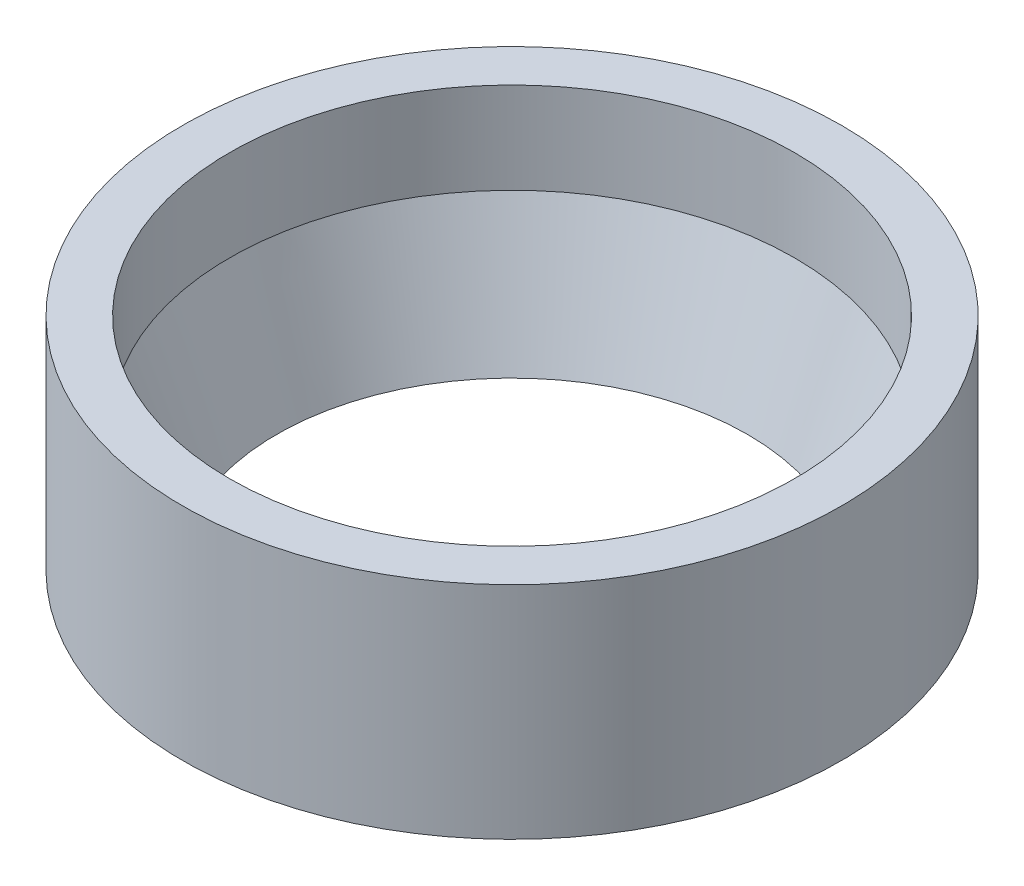
ISO-10303-21;
HEADER;
FILE_DESCRIPTION(('STEP AP214'),'2;1');
FILE_NAME('part.step','',(''),(''),'','','');
FILE_SCHEMA(('AUTOMOTIVE_DESIGN { 1 0 10303 214 1 1 1 1 }'));
ENDSEC;
DATA;
#1=APPLICATION_CONTEXT('core data for automotive mechanical design processes');
#2=APPLICATION_PROTOCOL_DEFINITION('international standard','automotive_design',2000,#1);
#3=PRODUCT_CONTEXT('',#1,'mechanical');
#4=PRODUCT('Part','Part','',(#3));
#5=PRODUCT_RELATED_PRODUCT_CATEGORY('part','',(#4));
#6=PRODUCT_DEFINITION_FORMATION('','',#4);
#7=PRODUCT_DEFINITION_CONTEXT('part definition',#1,'design');
#8=PRODUCT_DEFINITION('design','',#6,#7);
#9=PRODUCT_DEFINITION_SHAPE('','',#8);
#10=(LENGTH_UNIT() NAMED_UNIT(*) SI_UNIT(.MILLI.,.METRE.));
#11=(NAMED_UNIT(*) PLANE_ANGLE_UNIT() SI_UNIT($,.RADIAN.));
#12=(NAMED_UNIT(*) SI_UNIT($,.STERADIAN.) SOLID_ANGLE_UNIT());
#13=UNCERTAINTY_MEASURE_WITH_UNIT(LENGTH_MEASURE(1.E-05),#10,'distance_accuracy_value','');
#14=(GEOMETRIC_REPRESENTATION_CONTEXT(3) GLOBAL_UNCERTAINTY_ASSIGNED_CONTEXT((#13)) GLOBAL_UNIT_ASSIGNED_CONTEXT((#10,
#11,#12)) REPRESENTATION_CONTEXT('',''));
#15=CARTESIAN_POINT('',(0.,0.,0.));
#16=DIRECTION('',(0.,0.,1.));
#17=DIRECTION('',(1.,0.,0.));
#18=AXIS2_PLACEMENT_3D('',#15,#16,#17);
#19=CARTESIAN_POINT('',(0.,0.,0.));
#20=DIRECTION('',(0.,-1.,0.));
#21=DIRECTION('',(0.,0.,-1.));
#22=AXIS2_PLACEMENT_3D('',#19,#20,#21);
#23=PLANE('',#22);
#24=CARTESIAN_POINT('',(0.,0.,0.));
#25=DIRECTION('',(0.,-1.,0.));
#26=DIRECTION('',(0.,0.,-1.));
#27=AXIS2_PLACEMENT_3D('',#24,#25,#26);
#28=CIRCLE('',#27,44.45);
#29=CARTESIAN_POINT('',(0.,0.,-44.45));
#30=VERTEX_POINT('',#29);
#31=EDGE_CURVE('E10',#30,#30,#28,.T.);
#32=ORIENTED_EDGE('',*,*,#31,.F.);
#33=EDGE_LOOP('',(#32));
#34=FACE_BOUND('',#33,.T.);
#35=CARTESIAN_POINT('',(0.,0.,0.));
#36=DIRECTION('',(0.,-1.,0.));
#37=DIRECTION('',(0.,0.,-1.));
#38=AXIS2_PLACEMENT_3D('',#35,#36,#37);
#39=CIRCLE('',#38,38.1);
#40=CARTESIAN_POINT('',(0.,0.,-38.1));
#41=VERTEX_POINT('',#40);
#42=EDGE_CURVE('E53',#41,#41,#39,.T.);
#43=ORIENTED_EDGE('',*,*,#42,.T.);
#44=EDGE_LOOP('',(#43));
#45=FACE_BOUND('',#44,.T.);
#46=ADVANCED_FACE('F34',(#34,#45),#23,.F.);
#47=CARTESIAN_POINT('',(0.,0.,0.));
#48=DIRECTION('',(0.,-1.,0.));
#49=DIRECTION('',(0.,0.,-1.));
#50=AXIS2_PLACEMENT_3D('',#47,#48,#49);
#51=CYLINDRICAL_SURFACE('',#50,44.45);
#52=CARTESIAN_POINT('',(0.,-29.7434,0.));
#53=DIRECTION('',(0.,-1.,0.));
#54=DIRECTION('',(0.,0.,-1.));
#55=AXIS2_PLACEMENT_3D('',#52,#53,#54);
#56=CIRCLE('',#55,44.45);
#57=CARTESIAN_POINT('',(0.,-29.7434,-44.45));
#58=VERTEX_POINT('',#57);
#59=EDGE_CURVE('E40',#58,#58,#56,.T.);
#60=ORIENTED_EDGE('',*,*,#59,.F.);
#61=EDGE_LOOP('',(#60));
#62=FACE_BOUND('',#61,.T.);
#63=ORIENTED_EDGE('',*,*,#31,.T.);
#64=EDGE_LOOP('',(#63));
#65=FACE_BOUND('',#64,.T.);
#66=ADVANCED_FACE('F70',(#62,#65),#51,.T.);
#67=CARTESIAN_POINT('',(0.,-29.7434,0.));
#68=DIRECTION('',(0.,-1.,0.));
#69=DIRECTION('',(0.,0.,-1.));
#70=AXIS2_PLACEMENT_3D('',#67,#68,#69);
#71=PLANE('',#70);
#72=ORIENTED_EDGE('',*,*,#59,.T.);
#73=EDGE_LOOP('',(#72));
#74=FACE_BOUND('',#73,.T.);
#75=CARTESIAN_POINT('',(0.,-29.7434,0.));
#76=DIRECTION('',(0.,-1.,0.));
#77=DIRECTION('',(0.,0.,-1.));
#78=AXIS2_PLACEMENT_3D('',#75,#76,#77);
#79=CIRCLE('',#78,31.75);
#80=CARTESIAN_POINT('',(0.,-29.7434,-31.75));
#81=VERTEX_POINT('',#80);
#82=EDGE_CURVE('E44',#81,#81,#79,.T.);
#83=ORIENTED_EDGE('',*,*,#82,.F.);
#84=EDGE_LOOP('',(#83));
#85=FACE_BOUND('',#84,.T.);
#86=ADVANCED_FACE('F66',(#74,#85),#71,.T.);
#87=CARTESIAN_POINT('',(0.,-12.2969183864634,0.));
#88=DIRECTION('',(0.,1.,0.));
#89=DIRECTION('',(0.,0.,1.));
#90=AXIS2_PLACEMENT_3D('',#87,#88,#89);
#91=CONICAL_SURFACE('',#90,38.1,0.34906585039887);
#92=ORIENTED_EDGE('',*,*,#82,.T.);
#93=EDGE_LOOP('',(#92));
#94=FACE_BOUND('',#93,.T.);
#95=CARTESIAN_POINT('',(0.,-12.2969183864634,0.));
#96=DIRECTION('',(0.,-1.,0.));
#97=DIRECTION('',(0.,0.,-1.));
#98=AXIS2_PLACEMENT_3D('',#95,#96,#97);
#99=CIRCLE('',#98,38.1);
#100=CARTESIAN_POINT('',(0.,-12.2969183864634,-38.1));
#101=VERTEX_POINT('',#100);
#102=EDGE_CURVE('E48',#101,#101,#99,.T.);
#103=ORIENTED_EDGE('',*,*,#102,.F.);
#104=EDGE_LOOP('',(#103));
#105=FACE_BOUND('',#104,.T.);
#106=ADVANCED_FACE('F60',(#94,#105),#91,.F.);
#107=CARTESIAN_POINT('',(0.,0.,0.));
#108=DIRECTION('',(0.,-1.,0.));
#109=DIRECTION('',(0.,0.,-1.));
#110=AXIS2_PLACEMENT_3D('',#107,#108,#109);
#111=CYLINDRICAL_SURFACE('',#110,38.1);
#112=ORIENTED_EDGE('',*,*,#102,.T.);
#113=EDGE_LOOP('',(#112));
#114=FACE_BOUND('',#113,.T.);
#115=ORIENTED_EDGE('',*,*,#42,.F.);
#116=EDGE_LOOP('',(#115));
#117=FACE_BOUND('',#116,.T.);
#118=ADVANCED_FACE('F58',(#114,#117),#111,.F.);
#119=CLOSED_SHELL('',(#46,#66,#86,#106,#118));
#120=MANIFOLD_SOLID_BREP('B2',#119);
#121=ADVANCED_BREP_SHAPE_REPRESENTATION('',(#18,#120),#14);
#122=SHAPE_DEFINITION_REPRESENTATION(#9,#121);
ENDSEC;
END-ISO-10303-21;
